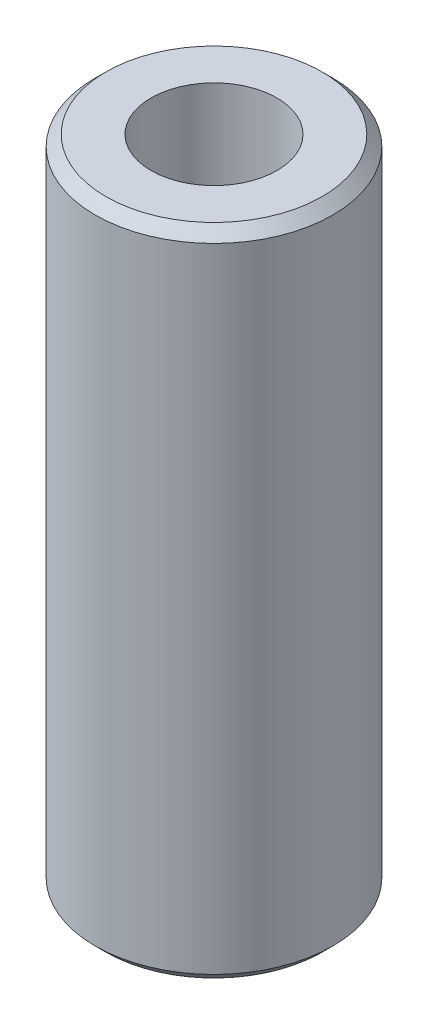
ISO-10303-21;
HEADER;
FILE_DESCRIPTION(('STEP AP214'),'2;1');
FILE_NAME('part.step','',(''),(''),'','','');
FILE_SCHEMA(('AUTOMOTIVE_DESIGN { 1 0 10303 214 1 1 1 1 }'));
ENDSEC;
DATA;
#1=APPLICATION_CONTEXT('core data for automotive mechanical design processes');
#2=APPLICATION_PROTOCOL_DEFINITION('international standard','automotive_design',2000,#1);
#3=PRODUCT_CONTEXT('',#1,'mechanical');
#4=PRODUCT('Part','Part','',(#3));
#5=PRODUCT_RELATED_PRODUCT_CATEGORY('part','',(#4));
#6=PRODUCT_DEFINITION_FORMATION('','',#4);
#7=PRODUCT_DEFINITION_CONTEXT('part definition',#1,'design');
#8=PRODUCT_DEFINITION('design','',#6,#7);
#9=PRODUCT_DEFINITION_SHAPE('','',#8);
#10=(LENGTH_UNIT() NAMED_UNIT(*) SI_UNIT(.MILLI.,.METRE.));
#11=(NAMED_UNIT(*) PLANE_ANGLE_UNIT() SI_UNIT($,.RADIAN.));
#12=(NAMED_UNIT(*) SI_UNIT($,.STERADIAN.) SOLID_ANGLE_UNIT());
#13=UNCERTAINTY_MEASURE_WITH_UNIT(LENGTH_MEASURE(1.E-05),#10,'distance_accuracy_value','');
#14=(GEOMETRIC_REPRESENTATION_CONTEXT(3) GLOBAL_UNCERTAINTY_ASSIGNED_CONTEXT((#13)) GLOBAL_UNIT_ASSIGNED_CONTEXT((#10,
#11,#12)) REPRESENTATION_CONTEXT('',''));
#15=CARTESIAN_POINT('',(0.,0.,0.));
#16=DIRECTION('',(0.,0.,1.));
#17=DIRECTION('',(1.,0.,0.));
#18=AXIS2_PLACEMENT_3D('',#15,#16,#17);
#19=CARTESIAN_POINT('',(0.,248.028740991299,0.));
#20=DIRECTION('',(0.,-1.,0.));
#21=DIRECTION('',(0.,0.,-1.));
#22=AXIS2_PLACEMENT_3D('',#19,#20,#21);
#23=CYLINDRICAL_SURFACE('',#22,45.);
#24=CARTESIAN_POINT('',(0.,243.995780518464,0.));
#25=DIRECTION('',(0.,1.,0.));
#26=DIRECTION('',(0.,0.,1.));
#27=AXIS2_PLACEMENT_3D('',#24,#25,#26);
#28=CIRCLE('',#27,45.);
#29=CARTESIAN_POINT('',(0.,243.995780518464,45.));
#30=VERTEX_POINT('',#29);
#31=EDGE_CURVE('E50',#30,#30,#28,.F.);
#32=ORIENTED_EDGE('',*,*,#31,.T.);
#33=EDGE_LOOP('',(#32));
#34=FACE_BOUND('',#33,.T.);
#35=CARTESIAN_POINT('',(0.,4.03296047283552,0.));
#36=DIRECTION('',(0.,1.,0.));
#37=DIRECTION('',(0.,0.,1.));
#38=AXIS2_PLACEMENT_3D('',#35,#36,#37);
#39=CIRCLE('',#38,45.);
#40=CARTESIAN_POINT('',(0.,4.03296047283552,45.));
#41=VERTEX_POINT('',#40);
#42=EDGE_CURVE('E51',#41,#41,#39,.T.);
#43=ORIENTED_EDGE('',*,*,#42,.T.);
#44=EDGE_LOOP('',(#43));
#45=FACE_BOUND('',#44,.T.);
#46=ADVANCED_FACE('F39',(#34,#45),#23,.T.);
#47=CARTESIAN_POINT('',(0.,248.028740991299,0.));
#48=DIRECTION('',(0.,1.,0.));
#49=DIRECTION('',(0.,0.,1.));
#50=AXIS2_PLACEMENT_3D('',#47,#48,#49);
#51=PLANE('',#50);
#52=CARTESIAN_POINT('',(0.,248.028740991299,0.));
#53=DIRECTION('',(0.,1.,0.));
#54=DIRECTION('',(0.,0.,1.));
#55=AXIS2_PLACEMENT_3D('',#52,#53,#54);
#56=CIRCLE('',#55,40.9670395271645);
#57=CARTESIAN_POINT('',(0.,248.028740991299,40.9670395271645));
#58=VERTEX_POINT('',#57);
#59=EDGE_CURVE('E54',#58,#58,#56,.T.);
#60=ORIENTED_EDGE('',*,*,#59,.T.);
#61=EDGE_LOOP('',(#60));
#62=FACE_BOUND('',#61,.T.);
#63=CARTESIAN_POINT('',(0.,248.028740991299,0.));
#64=DIRECTION('',(0.,1.,0.));
#65=DIRECTION('',(0.,0.,1.));
#66=AXIS2_PLACEMENT_3D('',#63,#64,#65);
#67=CIRCLE('',#66,23.8627688471668);
#68=CARTESIAN_POINT('',(0.,248.028740991299,23.8627688471668));
#69=VERTEX_POINT('',#68);
#70=EDGE_CURVE('E58',#69,#69,#67,.T.);
#71=ORIENTED_EDGE('',*,*,#70,.F.);
#72=EDGE_LOOP('',(#71));
#73=FACE_BOUND('',#72,.T.);
#74=ADVANCED_FACE('F69',(#62,#73),#51,.T.);
#75=CARTESIAN_POINT('',(0.,0.,0.));
#76=DIRECTION('',(0.,1.,0.));
#77=DIRECTION('',(0.,0.,1.));
#78=AXIS2_PLACEMENT_3D('',#75,#76,#77);
#79=PLANE('',#78);
#80=CARTESIAN_POINT('',(0.,0.,0.));
#81=DIRECTION('',(0.,1.,0.));
#82=DIRECTION('',(0.,0.,1.));
#83=AXIS2_PLACEMENT_3D('',#80,#81,#82);
#84=CIRCLE('',#83,40.9670395271644);
#85=CARTESIAN_POINT('',(0.,0.,40.9670395271644));
#86=VERTEX_POINT('',#85);
#87=EDGE_CURVE('E10',#86,#86,#84,.F.);
#88=ORIENTED_EDGE('',*,*,#87,.T.);
#89=EDGE_LOOP('',(#88));
#90=FACE_BOUND('',#89,.T.);
#91=CARTESIAN_POINT('',(0.,0.,0.));
#92=DIRECTION('',(0.,1.,0.));
#93=DIRECTION('',(0.,0.,1.));
#94=AXIS2_PLACEMENT_3D('',#91,#92,#93);
#95=CIRCLE('',#94,23.8627688471668);
#96=CARTESIAN_POINT('',(0.,0.,23.8627688471668));
#97=VERTEX_POINT('',#96);
#98=EDGE_CURVE('E63',#97,#97,#95,.T.);
#99=ORIENTED_EDGE('',*,*,#98,.T.);
#100=EDGE_LOOP('',(#99));
#101=FACE_BOUND('',#100,.T.);
#102=ADVANCED_FACE('F75',(#90,#101),#79,.F.);
#103=CARTESIAN_POINT('',(0.,248.028740991299,0.));
#104=DIRECTION('',(0.,-1.,0.));
#105=DIRECTION('',(0.,0.,-1.));
#106=AXIS2_PLACEMENT_3D('',#103,#104,#105);
#107=CYLINDRICAL_SURFACE('',#106,23.8627688471668);
#108=ORIENTED_EDGE('',*,*,#70,.T.);
#109=EDGE_LOOP('',(#108));
#110=FACE_BOUND('',#109,.T.);
#111=ORIENTED_EDGE('',*,*,#98,.F.);
#112=EDGE_LOOP('',(#111));
#113=FACE_BOUND('',#112,.T.);
#114=ADVANCED_FACE('F70',(#110,#113),#107,.F.);
#115=CARTESIAN_POINT('',(0.,248.028740991299,0.));
#116=DIRECTION('',(0.,-1.,0.));
#117=DIRECTION('',(0.,0.,-1.));
#118=AXIS2_PLACEMENT_3D('',#115,#116,#117);
#119=CONICAL_SURFACE('',#118,40.9670395271645,0.785398163397444);
#120=ORIENTED_EDGE('',*,*,#31,.F.);
#121=EDGE_LOOP('',(#120));
#122=FACE_BOUND('',#121,.T.);
#123=ORIENTED_EDGE('',*,*,#59,.F.);
#124=EDGE_LOOP('',(#123));
#125=FACE_BOUND('',#124,.T.);
#126=ADVANCED_FACE('F81',(#122,#125),#119,.T.);
#127=CARTESIAN_POINT('',(0.,4.03296047283552,0.));
#128=DIRECTION('',(0.,1.,0.));
#129=DIRECTION('',(0.,0.,1.));
#130=AXIS2_PLACEMENT_3D('',#127,#128,#129);
#131=CONICAL_SURFACE('',#130,45.,0.785398163397455);
#132=ORIENTED_EDGE('',*,*,#87,.F.);
#133=EDGE_LOOP('',(#132));
#134=FACE_BOUND('',#133,.T.);
#135=ORIENTED_EDGE('',*,*,#42,.F.);
#136=EDGE_LOOP('',(#135));
#137=FACE_BOUND('',#136,.T.);
#138=ADVANCED_FACE('F45',(#134,#137),#131,.T.);
#139=CLOSED_SHELL('',(#46,#74,#102,#114,#126,#138));
#140=MANIFOLD_SOLID_BREP('B2',#139);
#141=ADVANCED_BREP_SHAPE_REPRESENTATION('',(#18,#140),#14);
#142=SHAPE_DEFINITION_REPRESENTATION(#9,#141);
ENDSEC;
END-ISO-10303-21;
